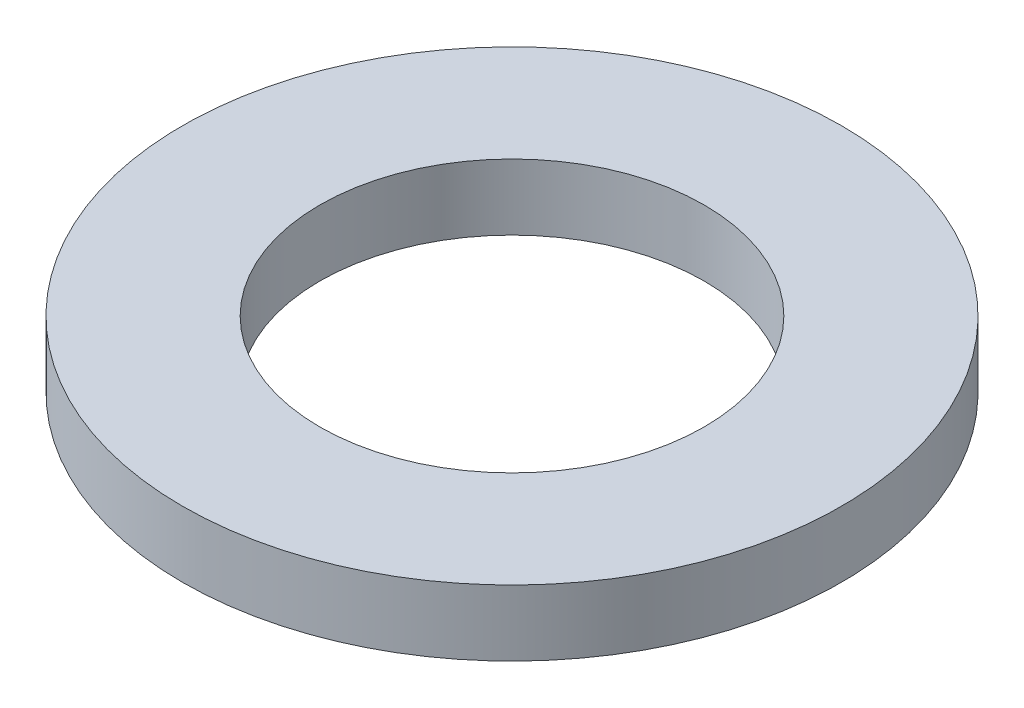
ISO-10303-21;
HEADER;
FILE_DESCRIPTION(('STEP AP214'),'2;1');
FILE_NAME('part.step','',(''),(''),'','','');
FILE_SCHEMA(('AUTOMOTIVE_DESIGN { 1 0 10303 214 1 1 1 1 }'));
ENDSEC;
DATA;
#1=APPLICATION_CONTEXT('core data for automotive mechanical design processes');
#2=APPLICATION_PROTOCOL_DEFINITION('international standard','automotive_design',2000,#1);
#3=PRODUCT_CONTEXT('',#1,'mechanical');
#4=PRODUCT('Part','Part','',(#3));
#5=PRODUCT_RELATED_PRODUCT_CATEGORY('part','',(#4));
#6=PRODUCT_DEFINITION_FORMATION('','',#4);
#7=PRODUCT_DEFINITION_CONTEXT('part definition',#1,'design');
#8=PRODUCT_DEFINITION('design','',#6,#7);
#9=PRODUCT_DEFINITION_SHAPE('','',#8);
#10=(LENGTH_UNIT() NAMED_UNIT(*) SI_UNIT(.MILLI.,.METRE.));
#11=(NAMED_UNIT(*) PLANE_ANGLE_UNIT() SI_UNIT($,.RADIAN.));
#12=(NAMED_UNIT(*) SI_UNIT($,.STERADIAN.) SOLID_ANGLE_UNIT());
#13=UNCERTAINTY_MEASURE_WITH_UNIT(LENGTH_MEASURE(1.E-05),#10,'distance_accuracy_value','');
#14=(GEOMETRIC_REPRESENTATION_CONTEXT(3) GLOBAL_UNCERTAINTY_ASSIGNED_CONTEXT((#13)) GLOBAL_UNIT_ASSIGNED_CONTEXT((#10,
#11,#12)) REPRESENTATION_CONTEXT('',''));
#15=CARTESIAN_POINT('',(0.,0.,0.));
#16=DIRECTION('',(0.,0.,1.));
#17=DIRECTION('',(1.,0.,0.));
#18=AXIS2_PLACEMENT_3D('',#15,#16,#17);
#19=CARTESIAN_POINT('',(0.,12.,0.));
#20=DIRECTION('',(0.,-1.,0.));
#21=DIRECTION('',(0.,0.,-1.));
#22=AXIS2_PLACEMENT_3D('',#19,#20,#21);
#23=CYLINDRICAL_SURFACE('',#22,60.);
#24=CARTESIAN_POINT('',(0.,12.,0.));
#25=DIRECTION('',(0.,1.,0.));
#26=DIRECTION('',(0.,0.,1.));
#27=AXIS2_PLACEMENT_3D('',#24,#25,#26);
#28=CIRCLE('',#27,60.);
#29=CARTESIAN_POINT('',(0.,12.,60.));
#30=VERTEX_POINT('',#29);
#31=EDGE_CURVE('E10',#30,#30,#28,.T.);
#32=ORIENTED_EDGE('',*,*,#31,.F.);
#33=EDGE_LOOP('',(#32));
#34=FACE_BOUND('',#33,.T.);
#35=CARTESIAN_POINT('',(0.,0.,0.));
#36=DIRECTION('',(0.,1.,0.));
#37=DIRECTION('',(0.,0.,1.));
#38=AXIS2_PLACEMENT_3D('',#35,#36,#37);
#39=CIRCLE('',#38,60.);
#40=CARTESIAN_POINT('',(0.,0.,60.));
#41=VERTEX_POINT('',#40);
#42=EDGE_CURVE('E37',#41,#41,#39,.T.);
#43=ORIENTED_EDGE('',*,*,#42,.T.);
#44=EDGE_LOOP('',(#43));
#45=FACE_BOUND('',#44,.T.);
#46=ADVANCED_FACE('F40',(#34,#45),#23,.T.);
#47=CARTESIAN_POINT('',(0.,12.,0.));
#48=DIRECTION('',(0.,1.,0.));
#49=DIRECTION('',(0.,0.,1.));
#50=AXIS2_PLACEMENT_3D('',#47,#48,#49);
#51=PLANE('',#50);
#52=CARTESIAN_POINT('',(0.,12.,0.));
#53=DIRECTION('',(0.,1.,0.));
#54=DIRECTION('',(0.,0.,1.));
#55=AXIS2_PLACEMENT_3D('',#52,#53,#54);
#56=CIRCLE('',#55,35.);
#57=CARTESIAN_POINT('',(0.,12.,35.));
#58=VERTEX_POINT('',#57);
#59=EDGE_CURVE('E50',#58,#58,#56,.T.);
#60=ORIENTED_EDGE('',*,*,#59,.F.);
#61=EDGE_LOOP('',(#60));
#62=FACE_BOUND('',#61,.T.);
#63=ORIENTED_EDGE('',*,*,#31,.T.);
#64=EDGE_LOOP('',(#63));
#65=FACE_BOUND('',#64,.T.);
#66=ADVANCED_FACE('F59',(#62,#65),#51,.T.);
#67=CARTESIAN_POINT('',(0.,0.,0.));
#68=DIRECTION('',(0.,1.,0.));
#69=DIRECTION('',(0.,0.,1.));
#70=AXIS2_PLACEMENT_3D('',#67,#68,#69);
#71=PLANE('',#70);
#72=CARTESIAN_POINT('',(0.,0.,0.));
#73=DIRECTION('',(0.,1.,0.));
#74=DIRECTION('',(0.,0.,1.));
#75=AXIS2_PLACEMENT_3D('',#72,#73,#74);
#76=CIRCLE('',#75,35.);
#77=CARTESIAN_POINT('',(0.,0.,35.));
#78=VERTEX_POINT('',#77);
#79=EDGE_CURVE('E47',#78,#78,#76,.T.);
#80=ORIENTED_EDGE('',*,*,#79,.T.);
#81=EDGE_LOOP('',(#80));
#82=FACE_BOUND('',#81,.T.);
#83=ORIENTED_EDGE('',*,*,#42,.F.);
#84=EDGE_LOOP('',(#83));
#85=FACE_BOUND('',#84,.T.);
#86=ADVANCED_FACE('F58',(#82,#85),#71,.F.);
#87=CARTESIAN_POINT('',(0.,12.,0.));
#88=DIRECTION('',(0.,-1.,0.));
#89=DIRECTION('',(0.,0.,-1.));
#90=AXIS2_PLACEMENT_3D('',#87,#88,#89);
#91=CYLINDRICAL_SURFACE('',#90,35.);
#92=ORIENTED_EDGE('',*,*,#59,.T.);
#93=EDGE_LOOP('',(#92));
#94=FACE_BOUND('',#93,.T.);
#95=ORIENTED_EDGE('',*,*,#79,.F.);
#96=EDGE_LOOP('',(#95));
#97=FACE_BOUND('',#96,.T.);
#98=ADVANCED_FACE('F54',(#94,#97),#91,.F.);
#99=CLOSED_SHELL('',(#46,#66,#86,#98));
#100=MANIFOLD_SOLID_BREP('B2',#99);
#101=ADVANCED_BREP_SHAPE_REPRESENTATION('',(#18,#100),#14);
#102=SHAPE_DEFINITION_REPRESENTATION(#9,#101);
ENDSEC;
END-ISO-10303-21;
